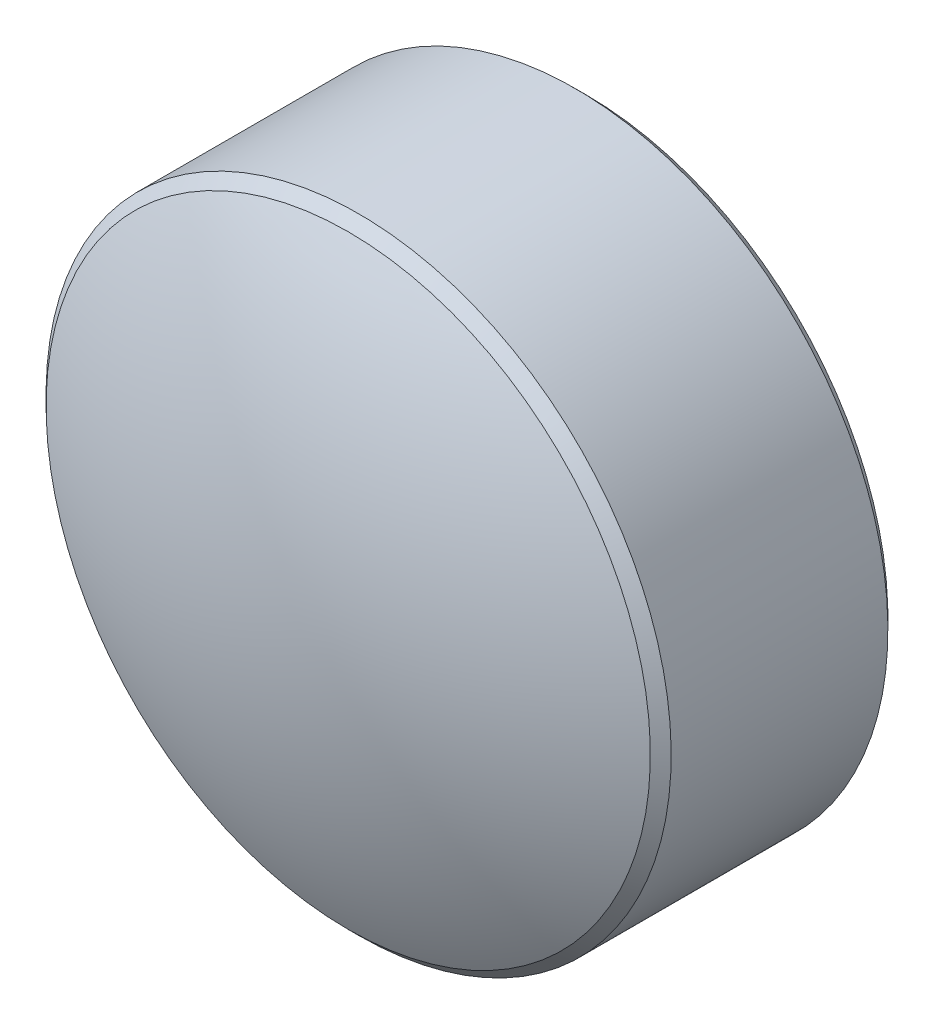
ISO-10303-21;
HEADER;
FILE_DESCRIPTION(('STEP AP214'),'2;1');
FILE_NAME('part.step','',(''),(''),'','','');
FILE_SCHEMA(('AUTOMOTIVE_DESIGN { 1 0 10303 214 1 1 1 1 }'));
ENDSEC;
DATA;
#1=APPLICATION_CONTEXT('core data for automotive mechanical design processes');
#2=APPLICATION_PROTOCOL_DEFINITION('international standard','automotive_design',2000,#1);
#3=PRODUCT_CONTEXT('',#1,'mechanical');
#4=PRODUCT('Part','Part','',(#3));
#5=PRODUCT_RELATED_PRODUCT_CATEGORY('part','',(#4));
#6=PRODUCT_DEFINITION_FORMATION('','',#4);
#7=PRODUCT_DEFINITION_CONTEXT('part definition',#1,'design');
#8=PRODUCT_DEFINITION('design','',#6,#7);
#9=PRODUCT_DEFINITION_SHAPE('','',#8);
#10=(LENGTH_UNIT() NAMED_UNIT(*) SI_UNIT(.MILLI.,.METRE.));
#11=(NAMED_UNIT(*) PLANE_ANGLE_UNIT() SI_UNIT($,.RADIAN.));
#12=(NAMED_UNIT(*) SI_UNIT($,.STERADIAN.) SOLID_ANGLE_UNIT());
#13=UNCERTAINTY_MEASURE_WITH_UNIT(LENGTH_MEASURE(1.E-05),#10,'distance_accuracy_value','');
#14=(GEOMETRIC_REPRESENTATION_CONTEXT(3) GLOBAL_UNCERTAINTY_ASSIGNED_CONTEXT((#13)) GLOBAL_UNIT_ASSIGNED_CONTEXT((#10,
#11,#12)) REPRESENTATION_CONTEXT('',''));
#15=CARTESIAN_POINT('',(0.,0.,0.));
#16=DIRECTION('',(0.,0.,1.));
#17=DIRECTION('',(1.,0.,0.));
#18=AXIS2_PLACEMENT_3D('',#15,#16,#17);
#19=CARTESIAN_POINT('',(0.992654256533111,1.82350476196263,1.44461901454158));
#20=DIRECTION('',(0.,0.,1.));
#21=DIRECTION('',(0.,-1.,0.));
#22=AXIS2_PLACEMENT_3D('',#19,#20,#21);
#23=PLANE('',#22);
#24=CARTESIAN_POINT('',(0.992654256533111,1.82350476196263,1.44461901454158));
#25=DIRECTION('',(0.,0.,1.));
#26=DIRECTION('',(0.,-1.,0.));
#27=AXIS2_PLACEMENT_3D('',#24,#25,#26);
#28=CIRCLE('',#27,1.45);
#29=CARTESIAN_POINT('',(0.992654256533111,0.373504761962626,1.44461901454158));
#30=VERTEX_POINT('',#29);
#31=EDGE_CURVE('E9',#30,#30,#28,.F.);
#32=ORIENTED_EDGE('',*,*,#31,.T.);
#33=EDGE_LOOP('',(#32));
#34=FACE_BOUND('',#33,.T.);
#35=ADVANCED_FACE('F13',(#34),#23,.F.);
#36=CARTESIAN_POINT('',(0.992654256533111,1.82350476196263,2.94461901454158));
#37=DIRECTION('',(0.,0.,1.));
#38=DIRECTION('',(0.,-1.,0.));
#39=AXIS2_PLACEMENT_3D('',#36,#37,#38);
#40=CYLINDRICAL_SURFACE('',#39,1.5);
#41=CARTESIAN_POINT('',(0.992654256533111,1.82350476196263,1.49461901454158));
#42=DIRECTION('',(0.,0.,1.));
#43=DIRECTION('',(0.,-1.,0.));
#44=AXIS2_PLACEMENT_3D('',#41,#42,#43);
#45=CIRCLE('',#44,1.5);
#46=CARTESIAN_POINT('',(0.992654256533111,0.323504761962626,1.49461901454158));
#47=VERTEX_POINT('',#46);
#48=EDGE_CURVE('E20',#47,#47,#45,.T.);
#49=ORIENTED_EDGE('',*,*,#48,.T.);
#50=EDGE_LOOP('',(#49));
#51=FACE_BOUND('',#50,.T.);
#52=CARTESIAN_POINT('',(0.992654256533111,1.82350476196263,2.5347321096181));
#53=DIRECTION('',(0.,0.,1.));
#54=DIRECTION('',(0.,-1.,0.));
#55=AXIS2_PLACEMENT_3D('',#52,#53,#54);
#56=CIRCLE('',#55,1.5);
#57=CARTESIAN_POINT('',(0.992654256533111,0.323504761962626,2.5347321096181));
#58=VERTEX_POINT('',#57);
#59=EDGE_CURVE('E24',#58,#58,#56,.T.);
#60=ORIENTED_EDGE('',*,*,#59,.F.);
#61=EDGE_LOOP('',(#60));
#62=FACE_BOUND('',#61,.T.);
#63=ADVANCED_FACE('F39',(#51,#62),#40,.T.);
#64=CARTESIAN_POINT('',(0.992654256533111,1.82350476196263,2.5347321096181));
#65=DIRECTION('',(0.,0.,-1.));
#66=DIRECTION('',(0.,1.,0.));
#67=AXIS2_PLACEMENT_3D('',#64,#65,#66);
#68=CONICAL_SURFACE('',#67,1.5,0.785398163397446);
#69=CARTESIAN_POINT('',(0.992654256533111,1.82350476196263,2.58473210961811));
#70=DIRECTION('',(0.,0.,1.));
#71=DIRECTION('',(0.,-1.,0.));
#72=AXIS2_PLACEMENT_3D('',#69,#70,#71);
#73=CIRCLE('',#72,1.45);
#74=CARTESIAN_POINT('',(0.992654256533111,0.373504761962626,2.58473210961811));
#75=VERTEX_POINT('',#74);
#76=EDGE_CURVE('E28',#75,#75,#73,.T.);
#77=ORIENTED_EDGE('',*,*,#76,.F.);
#78=EDGE_LOOP('',(#77));
#79=FACE_BOUND('',#78,.T.);
#80=ORIENTED_EDGE('',*,*,#59,.T.);
#81=EDGE_LOOP('',(#80));
#82=FACE_BOUND('',#81,.T.);
#83=ADVANCED_FACE('F36',(#79,#82),#68,.T.);
#84=CARTESIAN_POINT('',(0.992654256533111,1.82350476196263,-0.156380985458418));
#85=DIRECTION('',(0.,0.,1.));
#86=DIRECTION('',(0.,1.,0.));
#87=AXIS2_PLACEMENT_3D('',#84,#85,#86);
#88=SPHERICAL_SURFACE('',#87,3.101);
#89=ORIENTED_EDGE('',*,*,#76,.T.);
#90=EDGE_LOOP('',(#89));
#91=FACE_BOUND('',#90,.T.);
#92=ADVANCED_FACE('F34',(#91),#88,.T.);
#93=CARTESIAN_POINT('',(0.992654256533111,1.82350476196263,1.49461901454158));
#94=DIRECTION('',(0.,0.,1.));
#95=DIRECTION('',(0.,-1.,0.));
#96=AXIS2_PLACEMENT_3D('',#93,#94,#95);
#97=CONICAL_SURFACE('',#96,1.5,0.785398163397448);
#98=ORIENTED_EDGE('',*,*,#31,.F.);
#99=EDGE_LOOP('',(#98));
#100=FACE_BOUND('',#99,.T.);
#101=ORIENTED_EDGE('',*,*,#48,.F.);
#102=EDGE_LOOP('',(#101));
#103=FACE_BOUND('',#102,.T.);
#104=ADVANCED_FACE('F15',(#100,#103),#97,.T.);
#105=CLOSED_SHELL('',(#35,#63,#83,#92,#104));
#106=MANIFOLD_SOLID_BREP('B1',#105);
#107=ADVANCED_BREP_SHAPE_REPRESENTATION('',(#18,#106),#14);
#108=SHAPE_DEFINITION_REPRESENTATION(#9,#107);
ENDSEC;
END-ISO-10303-21;
